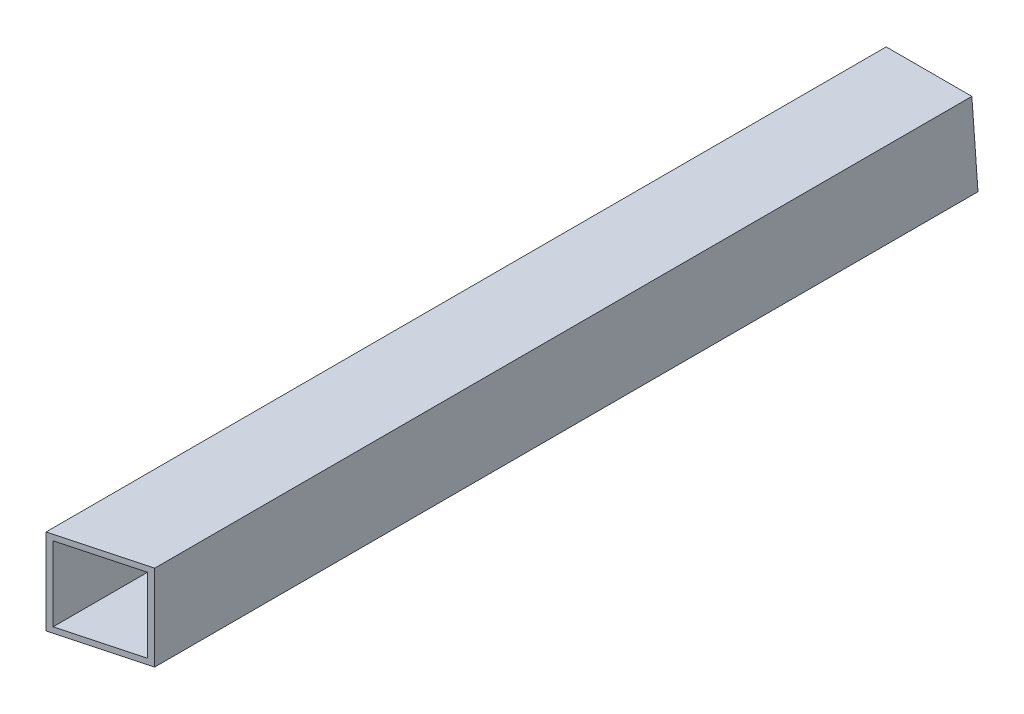
ISO-10303-21;
HEADER;
FILE_DESCRIPTION(('STEP AP214'),'2;1');
FILE_NAME('part.step','',(''),(''),'','','');
FILE_SCHEMA(('AUTOMOTIVE_DESIGN { 1 0 10303 214 1 1 1 1 }'));
ENDSEC;
DATA;
#1=APPLICATION_CONTEXT('core data for automotive mechanical design processes');
#2=APPLICATION_PROTOCOL_DEFINITION('international standard','automotive_design',2000,#1);
#3=PRODUCT_CONTEXT('',#1,'mechanical');
#4=PRODUCT('Part','Part','',(#3));
#5=PRODUCT_RELATED_PRODUCT_CATEGORY('part','',(#4));
#6=PRODUCT_DEFINITION_FORMATION('','',#4);
#7=PRODUCT_DEFINITION_CONTEXT('part definition',#1,'design');
#8=PRODUCT_DEFINITION('design','',#6,#7);
#9=PRODUCT_DEFINITION_SHAPE('','',#8);
#10=(LENGTH_UNIT() NAMED_UNIT(*) SI_UNIT(.MILLI.,.METRE.));
#11=(NAMED_UNIT(*) PLANE_ANGLE_UNIT() SI_UNIT($,.RADIAN.));
#12=(NAMED_UNIT(*) SI_UNIT($,.STERADIAN.) SOLID_ANGLE_UNIT());
#13=UNCERTAINTY_MEASURE_WITH_UNIT(LENGTH_MEASURE(1.E-05),#10,'distance_accuracy_value','');
#14=(GEOMETRIC_REPRESENTATION_CONTEXT(3) GLOBAL_UNCERTAINTY_ASSIGNED_CONTEXT((#13)) GLOBAL_UNIT_ASSIGNED_CONTEXT((#10,
#11,#12)) REPRESENTATION_CONTEXT('',''));
#15=CARTESIAN_POINT('',(0.,0.,0.));
#16=DIRECTION('',(0.,0.,1.));
#17=DIRECTION('',(1.,0.,0.));
#18=AXIS2_PLACEMENT_3D('',#15,#16,#17);
#19=CARTESIAN_POINT('',(-12.7,12.7,-250.));
#20=DIRECTION('',(-1.,0.,0.));
#21=DIRECTION('',(0.,0.,1.));
#22=AXIS2_PLACEMENT_3D('',#19,#20,#21);
#23=PLANE('',#22);
#24=DIRECTION('',(0.,0.,1.));
#25=VECTOR('',#24,1.);
#26=CARTESIAN_POINT('',(-12.7,12.7,-250.));
#27=LINE('',#26,#25);
#28=CARTESIAN_POINT('',(-12.7,12.7,-249.090766652217));
#29=VERTEX_POINT('',#28);
#30=CARTESIAN_POINT('',(-12.7,12.7,0.));
#31=VERTEX_POINT('',#30);
#32=EDGE_CURVE('E40',#29,#31,#27,.T.);
#33=ORIENTED_EDGE('',*,*,#32,.F.);
#34=DIRECTION('',(0.,-0.997447018462016,-0.0714104009317666));
#35=VECTOR('',#34,1.);
#36=CARTESIAN_POINT('',(-12.7,12.6352370439124,-249.095403237995));
#37=LINE('',#36,#35);
#38=CARTESIAN_POINT('',(-12.7,-12.7,-250.909233347785));
#39=VERTEX_POINT('',#38);
#40=EDGE_CURVE('E117',#29,#39,#37,.T.);
#41=ORIENTED_EDGE('',*,*,#40,.T.);
#42=DIRECTION('',(0.,0.,1.));
#43=VECTOR('',#42,1.);
#44=CARTESIAN_POINT('',(-12.7,-12.7,-250.));
#45=LINE('',#44,#43);
#46=CARTESIAN_POINT('',(-12.7,-12.7,0.));
#47=VERTEX_POINT('',#46);
#48=EDGE_CURVE('E106',#39,#47,#45,.T.);
#49=ORIENTED_EDGE('',*,*,#48,.T.);
#50=DIRECTION('',(0.,-1.,0.));
#51=VECTOR('',#50,1.);
#52=CARTESIAN_POINT('',(-12.7,12.7,0.));
#53=LINE('',#52,#51);
#54=EDGE_CURVE('E95',#31,#47,#53,.T.);
#55=ORIENTED_EDGE('',*,*,#54,.F.);
#56=EDGE_LOOP('',(#33,#41,#49,#55));
#57=FACE_BOUND('',#56,.T.);
#58=ADVANCED_FACE('F33',(#57),#23,.T.);
#59=CARTESIAN_POINT('',(12.7,12.7,-250.));
#60=DIRECTION('',(0.,1.,0.));
#61=DIRECTION('',(-1.,0.,0.));
#62=AXIS2_PLACEMENT_3D('',#59,#60,#61);
#63=PLANE('',#62);
#64=DIRECTION('',(0.96592582628907,0.,-0.258819045102514));
#65=VECTOR('',#64,1.);
#66=CARTESIAN_POINT('',(-12.7,12.7,0.));
#67=LINE('',#66,#65);
#68=CARTESIAN_POINT('',(12.7,12.7,-6.80590948775033));
#69=VERTEX_POINT('',#68);
#70=EDGE_CURVE('E101',#31,#69,#67,.T.);
#71=ORIENTED_EDGE('',*,*,#70,.T.);
#72=DIRECTION('',(0.,0.,1.));
#73=VECTOR('',#72,1.);
#74=CARTESIAN_POINT('',(12.7,12.7,-250.));
#75=LINE('',#74,#73);
#76=CARTESIAN_POINT('',(12.7,12.7,-249.090766652217));
#77=VERTEX_POINT('',#76);
#78=EDGE_CURVE('E118',#77,#69,#75,.T.);
#79=ORIENTED_EDGE('',*,*,#78,.F.);
#80=DIRECTION('',(-1.,0.,0.));
#81=VECTOR('',#80,1.);
#82=CARTESIAN_POINT('',(12.7,12.7,-249.090766652217));
#83=LINE('',#82,#81);
#84=EDGE_CURVE('E128',#77,#29,#83,.T.);
#85=ORIENTED_EDGE('',*,*,#84,.T.);
#86=ORIENTED_EDGE('',*,*,#32,.T.);
#87=EDGE_LOOP('',(#71,#79,#85,#86));
#88=FACE_BOUND('',#87,.T.);
#89=ADVANCED_FACE('F161',(#88),#63,.T.);
#90=CARTESIAN_POINT('',(12.7,12.7,-250.));
#91=DIRECTION('',(1.,0.,0.));
#92=DIRECTION('',(0.,1.,0.));
#93=AXIS2_PLACEMENT_3D('',#90,#91,#92);
#94=PLANE('',#93);
#95=DIRECTION('',(0.,1.,0.));
#96=VECTOR('',#95,1.);
#97=CARTESIAN_POINT('',(12.7,12.7,-6.80590948775031));
#98=LINE('',#97,#96);
#99=CARTESIAN_POINT('',(12.7,-12.7,-6.80590948775033));
#100=VERTEX_POINT('',#99);
#101=EDGE_CURVE('E148',#100,#69,#98,.T.);
#102=ORIENTED_EDGE('',*,*,#101,.F.);
#103=DIRECTION('',(0.,0.,1.));
#104=VECTOR('',#103,1.);
#105=CARTESIAN_POINT('',(12.7,-12.7,-250.));
#106=LINE('',#105,#104);
#107=CARTESIAN_POINT('',(12.7,-12.7,-250.909233347785));
#108=VERTEX_POINT('',#107);
#109=EDGE_CURVE('E114',#108,#100,#106,.T.);
#110=ORIENTED_EDGE('',*,*,#109,.F.);
#111=DIRECTION('',(0.,-0.997447018462016,-0.0714104009317666));
#112=VECTOR('',#111,1.);
#113=CARTESIAN_POINT('',(12.7,25.3847281800082,-248.182626662545));
#114=LINE('',#113,#112);
#115=EDGE_CURVE('E55',#77,#108,#114,.T.);
#116=ORIENTED_EDGE('',*,*,#115,.F.);
#117=ORIENTED_EDGE('',*,*,#78,.T.);
#118=EDGE_LOOP('',(#102,#110,#116,#117));
#119=FACE_BOUND('',#118,.T.);
#120=ADVANCED_FACE('F163',(#119),#94,.T.);
#121=CARTESIAN_POINT('',(12.7,-12.7,-250.));
#122=DIRECTION('',(0.,-1.,0.));
#123=DIRECTION('',(1.,0.,0.));
#124=AXIS2_PLACEMENT_3D('',#121,#122,#123);
#125=PLANE('',#124);
#126=DIRECTION('',(0.96592582628907,0.,-0.258819045102514));
#127=VECTOR('',#126,1.);
#128=CARTESIAN_POINT('',(-12.7,-12.7,0.));
#129=LINE('',#128,#127);
#130=EDGE_CURVE('E98',#47,#100,#129,.T.);
#131=ORIENTED_EDGE('',*,*,#130,.F.);
#132=ORIENTED_EDGE('',*,*,#48,.F.);
#133=DIRECTION('',(1.,0.,0.));
#134=VECTOR('',#133,1.);
#135=CARTESIAN_POINT('',(12.7,-12.7,-250.909233347785));
#136=LINE('',#135,#134);
#137=EDGE_CURVE('E139',#39,#108,#136,.T.);
#138=ORIENTED_EDGE('',*,*,#137,.T.);
#139=ORIENTED_EDGE('',*,*,#109,.T.);
#140=EDGE_LOOP('',(#131,#132,#138,#139));
#141=FACE_BOUND('',#140,.T.);
#142=ADVANCED_FACE('F112',(#141),#125,.T.);
#143=CARTESIAN_POINT('',(-11.049,11.049,-250.));
#144=DIRECTION('',(-1.,0.,0.));
#145=DIRECTION('',(0.,-1.,0.));
#146=AXIS2_PLACEMENT_3D('',#143,#144,#145);
#147=PLANE('',#146);
#148=DIRECTION('',(0.,0.,1.));
#149=VECTOR('',#148,1.);
#150=CARTESIAN_POINT('',(-11.049,11.049,-250.));
#151=LINE('',#150,#149);
#152=CARTESIAN_POINT('',(-11.049,11.049,-249.208966987429));
#153=VERTEX_POINT('',#152);
#154=CARTESIAN_POINT('',(-11.049,11.049,-0.442384116703758));
#155=VERTEX_POINT('',#154);
#156=EDGE_CURVE('E107',#153,#155,#151,.T.);
#157=ORIENTED_EDGE('',*,*,#156,.T.);
#158=DIRECTION('',(0.,-1.,0.));
#159=VECTOR('',#158,1.);
#160=CARTESIAN_POINT('',(-11.049,11.049,-0.442384116703776));
#161=LINE('',#160,#159);
#162=CARTESIAN_POINT('',(-11.049,-11.049,-0.442384116703758));
#163=VERTEX_POINT('',#162);
#164=EDGE_CURVE('E150',#155,#163,#161,.T.);
#165=ORIENTED_EDGE('',*,*,#164,.T.);
#166=DIRECTION('',(0.,0.,1.));
#167=VECTOR('',#166,1.);
#168=CARTESIAN_POINT('',(-11.049,-11.049,-250.));
#169=LINE('',#168,#167);
#170=CARTESIAN_POINT('',(-11.049,-11.049,-250.791033012573));
#171=VERTEX_POINT('',#170);
#172=EDGE_CURVE('E124',#171,#163,#169,.T.);
#173=ORIENTED_EDGE('',*,*,#172,.F.);
#174=DIRECTION('',(0.,-0.997447018462016,-0.0714104009317666));
#175=VECTOR('',#174,1.);
#176=CARTESIAN_POINT('',(-11.049,10.9926562282038,-249.213000817056));
#177=LINE('',#176,#175);
#178=EDGE_CURVE('E141',#153,#171,#177,.T.);
#179=ORIENTED_EDGE('',*,*,#178,.F.);
#180=EDGE_LOOP('',(#157,#165,#173,#179));
#181=FACE_BOUND('',#180,.T.);
#182=ADVANCED_FACE('F170',(#181),#147,.F.);
#183=CARTESIAN_POINT('',(11.049,11.049,-250.));
#184=DIRECTION('',(0.,1.,0.));
#185=DIRECTION('',(-1.,0.,0.));
#186=AXIS2_PLACEMENT_3D('',#183,#184,#185);
#187=PLANE('',#186);
#188=DIRECTION('',(0.,0.,1.));
#189=VECTOR('',#188,1.);
#190=CARTESIAN_POINT('',(11.049,11.049,-250.));
#191=LINE('',#190,#189);
#192=CARTESIAN_POINT('',(11.049,11.049,-249.208966987429));
#193=VERTEX_POINT('',#192);
#194=CARTESIAN_POINT('',(11.049,11.049,-6.36352537104656));
#195=VERTEX_POINT('',#194);
#196=EDGE_CURVE('E131',#193,#195,#191,.T.);
#197=ORIENTED_EDGE('',*,*,#196,.T.);
#198=DIRECTION('',(-0.96592582628907,0.,0.258819045102514));
#199=VECTOR('',#198,1.);
#200=CARTESIAN_POINT('',(71.9581186572369,11.049,-22.6840745269442));
#201=LINE('',#200,#199);
#202=EDGE_CURVE('E153',#195,#155,#201,.T.);
#203=ORIENTED_EDGE('',*,*,#202,.T.);
#204=ORIENTED_EDGE('',*,*,#156,.F.);
#205=DIRECTION('',(-1.,0.,0.));
#206=VECTOR('',#205,1.);
#207=CARTESIAN_POINT('',(11.049,11.049,-249.208966987429));
#208=LINE('',#207,#206);
#209=EDGE_CURVE('E143',#193,#153,#208,.T.);
#210=ORIENTED_EDGE('',*,*,#209,.F.);
#211=EDGE_LOOP('',(#197,#203,#204,#210));
#212=FACE_BOUND('',#211,.T.);
#213=ADVANCED_FACE('F207',(#212),#187,.F.);
#214=CARTESIAN_POINT('',(11.049,11.049,-250.));
#215=DIRECTION('',(1.,0.,0.));
#216=DIRECTION('',(0.,1.,0.));
#217=AXIS2_PLACEMENT_3D('',#214,#215,#216);
#218=PLANE('',#217);
#219=DIRECTION('',(0.,0.,1.));
#220=VECTOR('',#219,1.);
#221=CARTESIAN_POINT('',(11.049,-11.049,-250.));
#222=LINE('',#221,#220);
#223=CARTESIAN_POINT('',(11.049,-11.049,-250.791033012573));
#224=VERTEX_POINT('',#223);
#225=CARTESIAN_POINT('',(11.049,-11.049,-6.36352537104655));
#226=VERTEX_POINT('',#225);
#227=EDGE_CURVE('E127',#224,#226,#222,.T.);
#228=ORIENTED_EDGE('',*,*,#227,.T.);
#229=DIRECTION('',(0.,1.,0.));
#230=VECTOR('',#229,1.);
#231=CARTESIAN_POINT('',(11.049,11.049,-6.36352537104656));
#232=LINE('',#231,#230);
#233=EDGE_CURVE('E47',#226,#195,#232,.T.);
#234=ORIENTED_EDGE('',*,*,#233,.T.);
#235=ORIENTED_EDGE('',*,*,#196,.F.);
#236=DIRECTION('',(0.,0.997447018462016,0.0714104009317666));
#237=VECTOR('',#236,1.);
#238=CARTESIAN_POINT('',(11.049,10.9926562282038,-249.213000817056));
#239=LINE('',#238,#237);
#240=EDGE_CURVE('E145',#224,#193,#239,.T.);
#241=ORIENTED_EDGE('',*,*,#240,.F.);
#242=EDGE_LOOP('',(#228,#234,#235,#241));
#243=FACE_BOUND('',#242,.T.);
#244=ADVANCED_FACE('F218',(#243),#218,.F.);
#245=CARTESIAN_POINT('',(11.049,-11.049,-250.));
#246=DIRECTION('',(0.,-1.,0.));
#247=DIRECTION('',(1.,0.,0.));
#248=AXIS2_PLACEMENT_3D('',#245,#246,#247);
#249=PLANE('',#248);
#250=ORIENTED_EDGE('',*,*,#172,.T.);
#251=DIRECTION('',(0.96592582628907,0.,-0.258819045102514));
#252=VECTOR('',#251,1.);
#253=CARTESIAN_POINT('',(71.9581186572369,-11.049,-22.6840745269442));
#254=LINE('',#253,#252);
#255=EDGE_CURVE('E157',#163,#226,#254,.T.);
#256=ORIENTED_EDGE('',*,*,#255,.T.);
#257=ORIENTED_EDGE('',*,*,#227,.F.);
#258=DIRECTION('',(1.,0.,0.));
#259=VECTOR('',#258,1.);
#260=CARTESIAN_POINT('',(11.049,-11.049,-250.791033012573));
#261=LINE('',#260,#259);
#262=EDGE_CURVE('E11',#171,#224,#261,.T.);
#263=ORIENTED_EDGE('',*,*,#262,.F.);
#264=EDGE_LOOP('',(#250,#256,#257,#263));
#265=FACE_BOUND('',#264,.T.);
#266=ADVANCED_FACE('F229',(#265),#249,.F.);
#267=CARTESIAN_POINT('',(12.7,25.3847281800082,-248.182626662545));
#268=DIRECTION('',(0.,0.0714104009317666,-0.997447018462016));
#269=DIRECTION('',(0.,0.997447018462016,0.0714104009317666));
#270=AXIS2_PLACEMENT_3D('',#267,#268,#269);
#271=PLANE('',#270);
#272=ORIENTED_EDGE('',*,*,#115,.T.);
#273=ORIENTED_EDGE('',*,*,#137,.F.);
#274=ORIENTED_EDGE('',*,*,#40,.F.);
#275=ORIENTED_EDGE('',*,*,#84,.F.);
#276=EDGE_LOOP('',(#272,#273,#274,#275));
#277=FACE_BOUND('',#276,.T.);
#278=ORIENTED_EDGE('',*,*,#178,.T.);
#279=ORIENTED_EDGE('',*,*,#262,.T.);
#280=ORIENTED_EDGE('',*,*,#240,.T.);
#281=ORIENTED_EDGE('',*,*,#209,.T.);
#282=EDGE_LOOP('',(#278,#279,#280,#281));
#283=FACE_BOUND('',#282,.T.);
#284=ADVANCED_FACE('F179',(#277,#283),#271,.T.);
#285=CARTESIAN_POINT('',(-12.7,12.7,0.));
#286=DIRECTION('',(-0.258819045102514,0.,-0.96592582628907));
#287=DIRECTION('',(-0.96592582628907,0.,0.258819045102514));
#288=AXIS2_PLACEMENT_3D('',#285,#286,#287);
#289=PLANE('',#288);
#290=ORIENTED_EDGE('',*,*,#101,.T.);
#291=ORIENTED_EDGE('',*,*,#70,.F.);
#292=ORIENTED_EDGE('',*,*,#54,.T.);
#293=ORIENTED_EDGE('',*,*,#130,.T.);
#294=EDGE_LOOP('',(#290,#291,#292,#293));
#295=FACE_BOUND('',#294,.T.);
#296=ORIENTED_EDGE('',*,*,#202,.F.);
#297=ORIENTED_EDGE('',*,*,#233,.F.);
#298=ORIENTED_EDGE('',*,*,#255,.F.);
#299=ORIENTED_EDGE('',*,*,#164,.F.);
#300=EDGE_LOOP('',(#296,#297,#298,#299));
#301=FACE_BOUND('',#300,.T.);
#302=ADVANCED_FACE('F97',(#295,#301),#289,.F.);
#303=CLOSED_SHELL('',(#58,#89,#120,#142,#182,#213,#244,#266,#284,#302));
#304=MANIFOLD_SOLID_BREP('B2',#303);
#305=ADVANCED_BREP_SHAPE_REPRESENTATION('',(#18,#304),#14);
#306=SHAPE_DEFINITION_REPRESENTATION(#9,#305);
ENDSEC;
END-ISO-10303-21;
